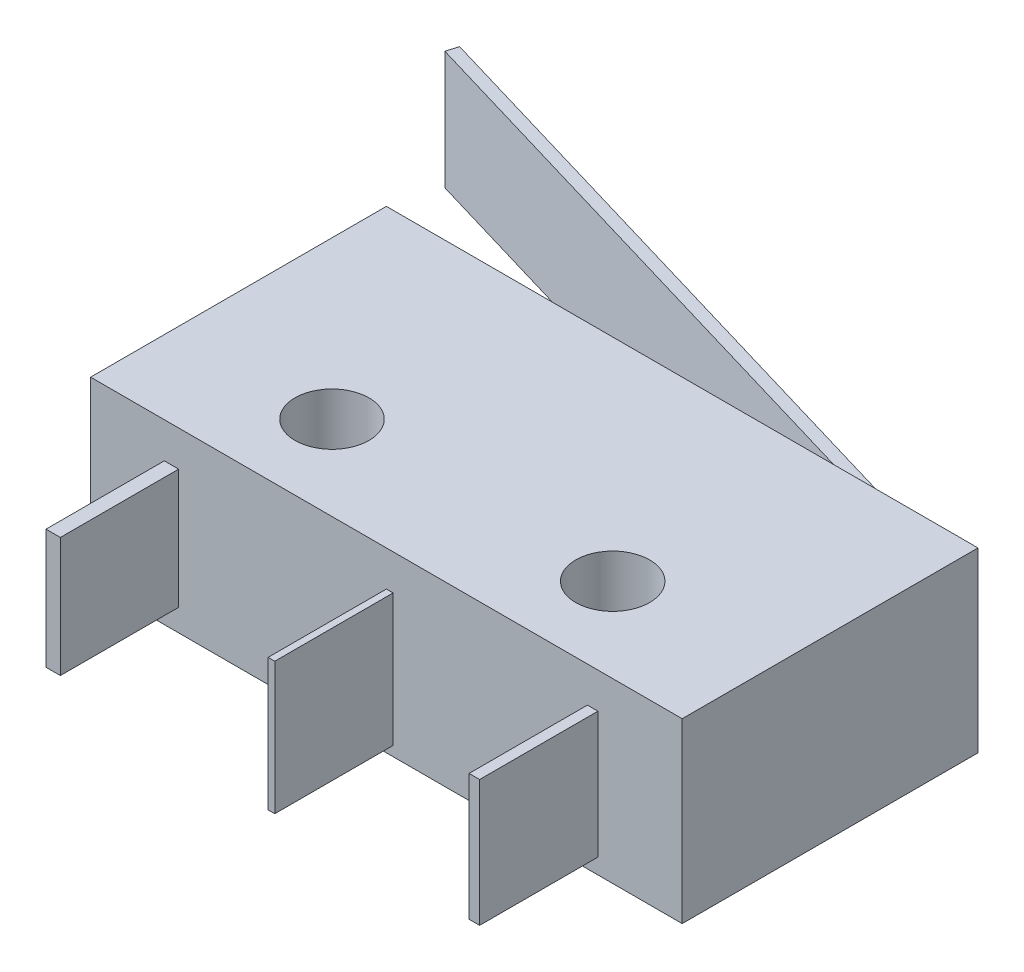
ISO-10303-21;
HEADER;
FILE_DESCRIPTION(('STEP AP214'),'2;1');
FILE_NAME('part.step','',(''),(''),'','','');
FILE_SCHEMA(('AUTOMOTIVE_DESIGN { 1 0 10303 214 1 1 1 1 }'));
ENDSEC;
DATA;
#1=APPLICATION_CONTEXT('core data for automotive mechanical design processes');
#2=APPLICATION_PROTOCOL_DEFINITION('international standard','automotive_design',2000,#1);
#3=PRODUCT_CONTEXT('',#1,'mechanical');
#4=PRODUCT('Part','Part','',(#3));
#5=PRODUCT_RELATED_PRODUCT_CATEGORY('part','',(#4));
#6=PRODUCT_DEFINITION_FORMATION('','',#4);
#7=PRODUCT_DEFINITION_CONTEXT('part definition',#1,'design');
#8=PRODUCT_DEFINITION('design','',#6,#7);
#9=PRODUCT_DEFINITION_SHAPE('','',#8);
#10=(LENGTH_UNIT() NAMED_UNIT(*) SI_UNIT(.MILLI.,.METRE.));
#11=(NAMED_UNIT(*) PLANE_ANGLE_UNIT() SI_UNIT($,.RADIAN.));
#12=(NAMED_UNIT(*) SI_UNIT($,.STERADIAN.) SOLID_ANGLE_UNIT());
#13=UNCERTAINTY_MEASURE_WITH_UNIT(LENGTH_MEASURE(1.E-05),#10,'distance_accuracy_value','');
#14=(GEOMETRIC_REPRESENTATION_CONTEXT(3) GLOBAL_UNCERTAINTY_ASSIGNED_CONTEXT((#13)) GLOBAL_UNIT_ASSIGNED_CONTEXT((#10,
#11,#12)) REPRESENTATION_CONTEXT('',''));
#15=CARTESIAN_POINT('',(0.,0.,0.));
#16=DIRECTION('',(0.,0.,1.));
#17=DIRECTION('',(1.,0.,0.));
#18=AXIS2_PLACEMENT_3D('',#15,#16,#17);
#19=CARTESIAN_POINT('',(7.61357254140113,1.,-5.38353784407759));
#20=DIRECTION('',(0.28393135350282,0.,-0.958844610193986));
#21=DIRECTION('',(-0.958844610193986,0.,-0.28393135350282));
#22=AXIS2_PLACEMENT_3D('',#19,#20,#21);
#23=PLANE('',#22);
#24=DIRECTION('',(-0.958844610193986,0.,-0.28393135350282));
#25=VECTOR('',#24,1.);
#26=CARTESIAN_POINT('',(7.61357254140113,5.,-5.38353784407759));
#27=LINE('',#26,#25);
#28=CARTESIAN_POINT('',(7.61357254140113,5.,-5.38353784407759));
#29=VERTEX_POINT('',#28);
#30=CARTESIAN_POINT('',(-14.4398534930605,5.,-11.9139589746425));
#31=VERTEX_POINT('',#30);
#32=EDGE_CURVE('E106',#29,#31,#27,.T.);
#33=ORIENTED_EDGE('',*,*,#32,.F.);
#34=DIRECTION('',(0.,1.,0.));
#35=VECTOR('',#34,1.);
#36=CARTESIAN_POINT('',(7.61357254140113,1.,-5.38353784407759));
#37=LINE('',#36,#35);
#38=CARTESIAN_POINT('',(7.61357254140113,1.,-5.38353784407759));
#39=VERTEX_POINT('',#38);
#40=EDGE_CURVE('E12',#39,#29,#37,.T.);
#41=ORIENTED_EDGE('',*,*,#40,.F.);
#42=DIRECTION('',(-0.958844610193986,0.,-0.28393135350282));
#43=VECTOR('',#42,1.);
#44=CARTESIAN_POINT('',(7.61357254140113,1.,-5.38353784407759));
#45=LINE('',#44,#43);
#46=CARTESIAN_POINT('',(-14.4398534930605,1.,-11.9139589746425));
#47=VERTEX_POINT('',#46);
#48=EDGE_CURVE('E101',#39,#47,#45,.T.);
#49=ORIENTED_EDGE('',*,*,#48,.T.);
#50=DIRECTION('',(0.,1.,0.));
#51=VECTOR('',#50,1.);
#52=CARTESIAN_POINT('',(-14.4398534930605,1.,-11.9139589746425));
#53=LINE('',#52,#51);
#54=EDGE_CURVE('E44',#47,#31,#53,.T.);
#55=ORIENTED_EDGE('',*,*,#54,.T.);
#56=EDGE_LOOP('',(#33,#41,#49,#55));
#57=FACE_BOUND('',#56,.T.);
#58=ADVANCED_FACE('F41',(#57),#23,.T.);
#59=CARTESIAN_POINT('',(7.61357254140113,1.,-5.38353784407759));
#60=DIRECTION('',(-0.958844610193986,0.,-0.28393135350282));
#61=DIRECTION('',(-0.28393135350282,0.,0.958844610193986));
#62=AXIS2_PLACEMENT_3D('',#59,#60,#61);
#63=PLANE('',#62);
#64=DIRECTION('',(-0.28393135350282,0.,0.958844610193986));
#65=VECTOR('',#64,1.);
#66=CARTESIAN_POINT('',(7.61357254140113,5.,-5.38353784407759));
#67=LINE('',#66,#65);
#68=CARTESIAN_POINT('',(7.5,5.,-5.));
#69=VERTEX_POINT('',#68);
#70=EDGE_CURVE('E74',#29,#69,#67,.T.);
#71=ORIENTED_EDGE('',*,*,#70,.T.);
#72=DIRECTION('',(0.,1.,0.));
#73=VECTOR('',#72,1.);
#74=CARTESIAN_POINT('',(7.5,1.,-5.));
#75=LINE('',#74,#73);
#76=CARTESIAN_POINT('',(7.5,1.,-5.));
#77=VERTEX_POINT('',#76);
#78=EDGE_CURVE('E50',#77,#69,#75,.T.);
#79=ORIENTED_EDGE('',*,*,#78,.F.);
#80=DIRECTION('',(-0.28393135350282,0.,0.958844610193986));
#81=VECTOR('',#80,1.);
#82=CARTESIAN_POINT('',(7.61357254140113,1.,-5.38353784407759));
#83=LINE('',#82,#81);
#84=EDGE_CURVE('E89',#39,#77,#83,.T.);
#85=ORIENTED_EDGE('',*,*,#84,.F.);
#86=ORIENTED_EDGE('',*,*,#40,.T.);
#87=EDGE_LOOP('',(#71,#79,#85,#86));
#88=FACE_BOUND('',#87,.T.);
#89=ADVANCED_FACE('F116',(#88),#63,.F.);
#90=CARTESIAN_POINT('',(7.5,1.,-5.));
#91=DIRECTION('',(0.28393135350282,0.,-0.958844610193986));
#92=DIRECTION('',(-0.958844610193986,0.,-0.28393135350282));
#93=AXIS2_PLACEMENT_3D('',#90,#91,#92);
#94=PLANE('',#93);
#95=DIRECTION('',(-0.958844610193986,0.,-0.28393135350282));
#96=VECTOR('',#95,1.);
#97=CARTESIAN_POINT('',(7.5,5.,-5.));
#98=LINE('',#97,#96);
#99=CARTESIAN_POINT('',(-14.5534260344617,5.,-11.5304211305649));
#100=VERTEX_POINT('',#99);
#101=EDGE_CURVE('E96',#69,#100,#98,.T.);
#102=ORIENTED_EDGE('',*,*,#101,.T.);
#103=DIRECTION('',(0.,1.,0.));
#104=VECTOR('',#103,1.);
#105=CARTESIAN_POINT('',(-14.5534260344617,1.,-11.5304211305649));
#106=LINE('',#105,#104);
#107=CARTESIAN_POINT('',(-14.5534260344617,1.,-11.5304211305649));
#108=VERTEX_POINT('',#107);
#109=EDGE_CURVE('E93',#108,#100,#106,.T.);
#110=ORIENTED_EDGE('',*,*,#109,.F.);
#111=DIRECTION('',(-0.958844610193986,0.,-0.28393135350282));
#112=VECTOR('',#111,1.);
#113=CARTESIAN_POINT('',(7.5,1.,-5.));
#114=LINE('',#113,#112);
#115=EDGE_CURVE('E86',#77,#108,#114,.T.);
#116=ORIENTED_EDGE('',*,*,#115,.F.);
#117=ORIENTED_EDGE('',*,*,#78,.T.);
#118=EDGE_LOOP('',(#102,#110,#116,#117));
#119=FACE_BOUND('',#118,.T.);
#120=ADVANCED_FACE('F94',(#119),#94,.F.);
#121=CARTESIAN_POINT('',(-14.5534260344617,1.,-11.5304211305649));
#122=DIRECTION('',(0.958844610193986,0.,0.28393135350282));
#123=DIRECTION('',(0.28393135350282,0.,-0.958844610193986));
#124=AXIS2_PLACEMENT_3D('',#121,#122,#123);
#125=PLANE('',#124);
#126=DIRECTION('',(0.28393135350282,0.,-0.958844610193986));
#127=VECTOR('',#126,1.);
#128=CARTESIAN_POINT('',(-14.5534260344617,5.,-11.5304211305649));
#129=LINE('',#128,#127);
#130=EDGE_CURVE('E109',#100,#31,#129,.T.);
#131=ORIENTED_EDGE('',*,*,#130,.T.);
#132=ORIENTED_EDGE('',*,*,#54,.F.);
#133=DIRECTION('',(0.28393135350282,0.,-0.958844610193986));
#134=VECTOR('',#133,1.);
#135=CARTESIAN_POINT('',(-14.5534260344617,1.,-11.5304211305649));
#136=LINE('',#135,#134);
#137=EDGE_CURVE('E83',#108,#47,#136,.T.);
#138=ORIENTED_EDGE('',*,*,#137,.F.);
#139=ORIENTED_EDGE('',*,*,#109,.T.);
#140=EDGE_LOOP('',(#131,#132,#138,#139));
#141=FACE_BOUND('',#140,.T.);
#142=ADVANCED_FACE('F100',(#141),#125,.F.);
#143=CARTESIAN_POINT('',(-14.4398534930605,1.,-11.9139589746425));
#144=DIRECTION('',(0.,-1.,0.));
#145=DIRECTION('',(0.,0.,-1.));
#146=AXIS2_PLACEMENT_3D('',#143,#144,#145);
#147=PLANE('',#146);
#148=ORIENTED_EDGE('',*,*,#48,.F.);
#149=ORIENTED_EDGE('',*,*,#84,.T.);
#150=ORIENTED_EDGE('',*,*,#115,.T.);
#151=ORIENTED_EDGE('',*,*,#137,.T.);
#152=EDGE_LOOP('',(#148,#149,#150,#151));
#153=FACE_BOUND('',#152,.T.);
#154=ADVANCED_FACE('F88',(#153),#147,.T.);
#155=CARTESIAN_POINT('',(-14.4398534930605,5.,-11.9139589746425));
#156=DIRECTION('',(0.,-1.,0.));
#157=DIRECTION('',(0.,0.,-1.));
#158=AXIS2_PLACEMENT_3D('',#155,#156,#157);
#159=PLANE('',#158);
#160=ORIENTED_EDGE('',*,*,#32,.T.);
#161=ORIENTED_EDGE('',*,*,#130,.F.);
#162=ORIENTED_EDGE('',*,*,#101,.F.);
#163=ORIENTED_EDGE('',*,*,#70,.F.);
#164=EDGE_LOOP('',(#160,#161,#162,#163));
#165=FACE_BOUND('',#164,.T.);
#166=ADVANCED_FACE('F114',(#165),#159,.F.);
#167=CLOSED_SHELL('',(#58,#89,#120,#142,#154,#166));
#168=MANIFOLD_SOLID_BREP('B2',#167);
#169=CARTESIAN_POINT('',(-10.,6.,5.));
#170=DIRECTION('',(0.,0.,-1.));
#171=DIRECTION('',(-1.,0.,0.));
#172=AXIS2_PLACEMENT_3D('',#169,#170,#171);
#173=PLANE('',#172);
#174=DIRECTION('',(0.,-1.,0.));
#175=VECTOR('',#174,1.);
#176=CARTESIAN_POINT('',(0.,4.79597395338313,5.));
#177=LINE('',#176,#175);
#178=CARTESIAN_POINT('',(0.,4.79597395338313,5.));
#179=VERTEX_POINT('',#178);
#180=CARTESIAN_POINT('',(0.,0.330308988214349,5.));
#181=VERTEX_POINT('',#180);
#182=EDGE_CURVE('E299',#179,#181,#177,.T.);
#183=ORIENTED_EDGE('',*,*,#182,.F.);
#184=DIRECTION('',(-1.,0.,0.));
#185=VECTOR('',#184,1.);
#186=CARTESIAN_POINT('',(0.,4.79597395338313,5.));
#187=LINE('',#186,#185);
#188=CARTESIAN_POINT('',(0.226519237363634,4.79597395338313,5.));
#189=VERTEX_POINT('',#188);
#190=EDGE_CURVE('E312',#189,#179,#187,.T.);
#191=ORIENTED_EDGE('',*,*,#190,.F.);
#192=DIRECTION('',(0.,1.,0.));
#193=VECTOR('',#192,1.);
#194=CARTESIAN_POINT('',(0.226519237363634,4.79597395338313,5.));
#195=LINE('',#194,#193);
#196=CARTESIAN_POINT('',(0.226519237363634,0.330308988214349,5.));
#197=VERTEX_POINT('',#196);
#198=EDGE_CURVE('E321',#197,#189,#195,.T.);
#199=ORIENTED_EDGE('',*,*,#198,.F.);
#200=DIRECTION('',(1.,0.,0.));
#201=VECTOR('',#200,1.);
#202=CARTESIAN_POINT('',(0.,0.330308988214349,5.));
#203=LINE('',#202,#201);
#204=EDGE_CURVE('E302',#181,#197,#203,.T.);
#205=ORIENTED_EDGE('',*,*,#204,.F.);
#206=EDGE_LOOP('',(#183,#191,#199,#205));
#207=FACE_BOUND('',#206,.T.);
#208=DIRECTION('',(1.,0.,0.));
#209=VECTOR('',#208,1.);
#210=CARTESIAN_POINT('',(-10.,0.,5.));
#211=LINE('',#210,#209);
#212=CARTESIAN_POINT('',(-10.,0.,5.));
#213=VERTEX_POINT('',#212);
#214=CARTESIAN_POINT('',(10.,0.,5.));
#215=VERTEX_POINT('',#214);
#216=EDGE_CURVE('E387',#213,#215,#211,.T.);
#217=ORIENTED_EDGE('',*,*,#216,.T.);
#218=DIRECTION('',(0.,-1.,0.));
#219=VECTOR('',#218,1.);
#220=CARTESIAN_POINT('',(10.,6.,5.));
#221=LINE('',#220,#219);
#222=CARTESIAN_POINT('',(10.,6.,5.));
#223=VERTEX_POINT('',#222);
#224=EDGE_CURVE('E393',#223,#215,#221,.T.);
#225=ORIENTED_EDGE('',*,*,#224,.F.);
#226=DIRECTION('',(1.,0.,0.));
#227=VECTOR('',#226,1.);
#228=CARTESIAN_POINT('',(-10.,6.,5.));
#229=LINE('',#228,#227);
#230=CARTESIAN_POINT('',(-10.,6.,5.));
#231=VERTEX_POINT('',#230);
#232=EDGE_CURVE('E391',#231,#223,#229,.T.);
#233=ORIENTED_EDGE('',*,*,#232,.F.);
#234=DIRECTION('',(0.,-1.,0.));
#235=VECTOR('',#234,1.);
#236=CARTESIAN_POINT('',(-10.,6.,5.));
#237=LINE('',#236,#235);
#238=EDGE_CURVE('E403',#231,#213,#237,.T.);
#239=ORIENTED_EDGE('',*,*,#238,.T.);
#240=EDGE_LOOP('',(#217,#225,#233,#239));
#241=FACE_BOUND('',#240,.T.);
#242=DIRECTION('',(0.,-1.,0.));
#243=VECTOR('',#242,1.);
#244=CARTESIAN_POINT('',(-7.50749472405187,4.79597395338313,5.));
#245=LINE('',#244,#243);
#246=CARTESIAN_POINT('',(-7.50749472405187,4.79597395338313,5.));
#247=VERTEX_POINT('',#246);
#248=CARTESIAN_POINT('',(-7.50749472405187,0.750987571889667,5.));
#249=VERTEX_POINT('',#248);
#250=EDGE_CURVE('E337',#247,#249,#245,.T.);
#251=ORIENTED_EDGE('',*,*,#250,.F.);
#252=DIRECTION('',(-1.,0.,0.));
#253=VECTOR('',#252,1.);
#254=CARTESIAN_POINT('',(-7.50749472405187,4.79597395338313,5.));
#255=LINE('',#254,#253);
#256=CARTESIAN_POINT('',(-7.02209635827265,4.79597395338313,5.));
#257=VERTEX_POINT('',#256);
#258=EDGE_CURVE('E342',#257,#247,#255,.T.);
#259=ORIENTED_EDGE('',*,*,#258,.F.);
#260=DIRECTION('',(0.,1.,0.));
#261=VECTOR('',#260,1.);
#262=CARTESIAN_POINT('',(-7.02209635827265,4.79597395338313,5.));
#263=LINE('',#262,#261);
#264=CARTESIAN_POINT('',(-7.02209635827265,0.750987571889667,5.));
#265=VERTEX_POINT('',#264);
#266=EDGE_CURVE('E354',#265,#257,#263,.T.);
#267=ORIENTED_EDGE('',*,*,#266,.F.);
#268=DIRECTION('',(1.,0.,0.));
#269=VECTOR('',#268,1.);
#270=CARTESIAN_POINT('',(-7.50749472405187,0.750987571889668,5.));
#271=LINE('',#270,#269);
#272=EDGE_CURVE('E351',#249,#265,#271,.T.);
#273=ORIENTED_EDGE('',*,*,#272,.F.);
#274=EDGE_LOOP('',(#251,#259,#267,#273));
#275=FACE_BOUND('',#274,.T.);
#276=DIRECTION('',(0.,-1.,0.));
#277=VECTOR('',#276,1.);
#278=CARTESIAN_POINT('',(6.79557712090902,4.79597395338313,5.));
#279=LINE('',#278,#277);
#280=CARTESIAN_POINT('',(6.79557712090902,4.79597395338313,5.));
#281=VERTEX_POINT('',#280);
#282=CARTESIAN_POINT('',(6.79557712090902,0.524468334526034,5.));
#283=VERTEX_POINT('',#282);
#284=EDGE_CURVE('E298',#281,#283,#279,.T.);
#285=ORIENTED_EDGE('',*,*,#284,.F.);
#286=DIRECTION('',(-1.,0.,0.));
#287=VECTOR('',#286,1.);
#288=CARTESIAN_POINT('',(6.79557712090902,4.79597395338313,5.));
#289=LINE('',#288,#287);
#290=CARTESIAN_POINT('',(7.15153592248044,4.79597395338313,5.));
#291=VERTEX_POINT('',#290);
#292=EDGE_CURVE('E295',#291,#281,#289,.T.);
#293=ORIENTED_EDGE('',*,*,#292,.F.);
#294=DIRECTION('',(0.,1.,0.));
#295=VECTOR('',#294,1.);
#296=CARTESIAN_POINT('',(7.15153592248044,4.79597395338313,5.));
#297=LINE('',#296,#295);
#298=CARTESIAN_POINT('',(7.15153592248044,0.524468334526034,5.));
#299=VERTEX_POINT('',#298);
#300=EDGE_CURVE('E185',#299,#291,#297,.T.);
#301=ORIENTED_EDGE('',*,*,#300,.F.);
#302=DIRECTION('',(1.,0.,0.));
#303=VECTOR('',#302,1.);
#304=CARTESIAN_POINT('',(6.79557712090902,0.524468334526034,5.));
#305=LINE('',#304,#303);
#306=EDGE_CURVE('E180',#283,#299,#305,.T.);
#307=ORIENTED_EDGE('',*,*,#306,.F.);
#308=EDGE_LOOP('',(#285,#293,#301,#307));
#309=FACE_BOUND('',#308,.T.);
#310=ADVANCED_FACE('F165',(#207,#241,#275,#309),#173,.F.);
#311=CARTESIAN_POINT('',(10.,6.,5.));
#312=DIRECTION('',(0.,1.,0.));
#313=DIRECTION('',(0.,0.,1.));
#314=AXIS2_PLACEMENT_3D('',#311,#312,#313);
#315=PLANE('',#314);
#316=CARTESIAN_POINT('',(-4.69,6.,2.15));
#317=DIRECTION('',(0.,1.,0.));
#318=DIRECTION('',(0.,0.,1.));
#319=AXIS2_PLACEMENT_3D('',#316,#317,#318);
#320=CIRCLE('',#319,1.25);
#321=CARTESIAN_POINT('',(-4.69,6.,3.4));
#322=VERTEX_POINT('',#321);
#323=EDGE_CURVE('E377',#322,#322,#320,.T.);
#324=ORIENTED_EDGE('',*,*,#323,.F.);
#325=EDGE_LOOP('',(#324));
#326=FACE_BOUND('',#325,.T.);
#327=DIRECTION('',(0.,0.,-1.));
#328=VECTOR('',#327,1.);
#329=CARTESIAN_POINT('',(10.,6.,-5.));
#330=LINE('',#329,#328);
#331=CARTESIAN_POINT('',(10.,6.,-5.));
#332=VERTEX_POINT('',#331);
#333=EDGE_CURVE('E383',#223,#332,#330,.T.);
#334=ORIENTED_EDGE('',*,*,#333,.T.);
#335=DIRECTION('',(-1.,0.,0.));
#336=VECTOR('',#335,1.);
#337=CARTESIAN_POINT('',(-10.,6.,-5.));
#338=LINE('',#337,#336);
#339=CARTESIAN_POINT('',(-10.,6.,-5.));
#340=VERTEX_POINT('',#339);
#341=EDGE_CURVE('E386',#332,#340,#338,.T.);
#342=ORIENTED_EDGE('',*,*,#341,.T.);
#343=DIRECTION('',(0.,0.,1.));
#344=VECTOR('',#343,1.);
#345=CARTESIAN_POINT('',(-10.,6.,-5.));
#346=LINE('',#345,#344);
#347=EDGE_CURVE('E389',#340,#231,#346,.T.);
#348=ORIENTED_EDGE('',*,*,#347,.T.);
#349=ORIENTED_EDGE('',*,*,#232,.T.);
#350=EDGE_LOOP('',(#334,#342,#348,#349));
#351=FACE_BOUND('',#350,.T.);
#352=CARTESIAN_POINT('',(4.8,6.,2.15));
#353=DIRECTION('',(0.,1.,0.));
#354=DIRECTION('',(0.,0.,1.));
#355=AXIS2_PLACEMENT_3D('',#352,#353,#354);
#356=CIRCLE('',#355,1.25);
#357=CARTESIAN_POINT('',(4.8,6.,3.4));
#358=VERTEX_POINT('',#357);
#359=EDGE_CURVE('E371',#358,#358,#356,.T.);
#360=ORIENTED_EDGE('',*,*,#359,.F.);
#361=EDGE_LOOP('',(#360));
#362=FACE_BOUND('',#361,.T.);
#363=ADVANCED_FACE('F426',(#326,#351,#362),#315,.T.);
#364=CARTESIAN_POINT('',(10.,0.,5.));
#365=DIRECTION('',(0.,1.,0.));
#366=DIRECTION('',(0.,0.,1.));
#367=AXIS2_PLACEMENT_3D('',#364,#365,#366);
#368=PLANE('',#367);
#369=CARTESIAN_POINT('',(-4.69,0.,2.15));
#370=DIRECTION('',(0.,1.,0.));
#371=DIRECTION('',(0.,0.,1.));
#372=AXIS2_PLACEMENT_3D('',#369,#370,#371);
#373=CIRCLE('',#372,1.25);
#374=CARTESIAN_POINT('',(-4.69,0.,3.4));
#375=VERTEX_POINT('',#374);
#376=EDGE_CURVE('E374',#375,#375,#373,.T.);
#377=ORIENTED_EDGE('',*,*,#376,.T.);
#378=EDGE_LOOP('',(#377));
#379=FACE_BOUND('',#378,.T.);
#380=DIRECTION('',(0.,0.,-1.));
#381=VECTOR('',#380,1.);
#382=CARTESIAN_POINT('',(10.,0.,-5.));
#383=LINE('',#382,#381);
#384=CARTESIAN_POINT('',(10.,0.,-5.));
#385=VERTEX_POINT('',#384);
#386=EDGE_CURVE('E380',#215,#385,#383,.T.);
#387=ORIENTED_EDGE('',*,*,#386,.F.);
#388=ORIENTED_EDGE('',*,*,#216,.F.);
#389=DIRECTION('',(0.,0.,1.));
#390=VECTOR('',#389,1.);
#391=CARTESIAN_POINT('',(-10.,0.,-5.));
#392=LINE('',#391,#390);
#393=CARTESIAN_POINT('',(-10.,0.,-5.));
#394=VERTEX_POINT('',#393);
#395=EDGE_CURVE('E398',#394,#213,#392,.T.);
#396=ORIENTED_EDGE('',*,*,#395,.F.);
#397=DIRECTION('',(-1.,0.,0.));
#398=VECTOR('',#397,1.);
#399=CARTESIAN_POINT('',(-10.,0.,-5.));
#400=LINE('',#399,#398);
#401=EDGE_CURVE('E396',#385,#394,#400,.T.);
#402=ORIENTED_EDGE('',*,*,#401,.F.);
#403=EDGE_LOOP('',(#387,#388,#396,#402));
#404=FACE_BOUND('',#403,.T.);
#405=CARTESIAN_POINT('',(4.8,0.,2.15));
#406=DIRECTION('',(0.,1.,0.));
#407=DIRECTION('',(0.,0.,1.));
#408=AXIS2_PLACEMENT_3D('',#405,#406,#407);
#409=CIRCLE('',#408,1.25);
#410=CARTESIAN_POINT('',(4.8,0.,3.4));
#411=VERTEX_POINT('',#410);
#412=EDGE_CURVE('E370',#411,#411,#409,.T.);
#413=ORIENTED_EDGE('',*,*,#412,.T.);
#414=EDGE_LOOP('',(#413));
#415=FACE_BOUND('',#414,.T.);
#416=ADVANCED_FACE('F416',(#379,#404,#415),#368,.F.);
#417=CARTESIAN_POINT('',(10.,6.,-5.));
#418=DIRECTION('',(-1.,0.,0.));
#419=DIRECTION('',(0.,0.,1.));
#420=AXIS2_PLACEMENT_3D('',#417,#418,#419);
#421=PLANE('',#420);
#422=ORIENTED_EDGE('',*,*,#386,.T.);
#423=DIRECTION('',(0.,-1.,0.));
#424=VECTOR('',#423,1.);
#425=CARTESIAN_POINT('',(10.,6.,-5.));
#426=LINE('',#425,#424);
#427=EDGE_CURVE('E39',#332,#385,#426,.T.);
#428=ORIENTED_EDGE('',*,*,#427,.F.);
#429=ORIENTED_EDGE('',*,*,#333,.F.);
#430=ORIENTED_EDGE('',*,*,#224,.T.);
#431=EDGE_LOOP('',(#422,#428,#429,#430));
#432=FACE_BOUND('',#431,.T.);
#433=ADVANCED_FACE('F167',(#432),#421,.F.);
#434=CARTESIAN_POINT('',(-10.,6.,-5.));
#435=DIRECTION('',(0.,0.,1.));
#436=DIRECTION('',(1.,0.,0.));
#437=AXIS2_PLACEMENT_3D('',#434,#435,#436);
#438=PLANE('',#437);
#439=ORIENTED_EDGE('',*,*,#401,.T.);
#440=DIRECTION('',(0.,-1.,0.));
#441=VECTOR('',#440,1.);
#442=CARTESIAN_POINT('',(-10.,6.,-5.));
#443=LINE('',#442,#441);
#444=EDGE_CURVE('E173',#340,#394,#443,.T.);
#445=ORIENTED_EDGE('',*,*,#444,.F.);
#446=ORIENTED_EDGE('',*,*,#341,.F.);
#447=ORIENTED_EDGE('',*,*,#427,.T.);
#448=EDGE_LOOP('',(#439,#445,#446,#447));
#449=FACE_BOUND('',#448,.T.);
#450=ADVANCED_FACE('F428',(#449),#438,.F.);
#451=CARTESIAN_POINT('',(-10.,6.,-5.));
#452=DIRECTION('',(1.,0.,0.));
#453=DIRECTION('',(0.,0.,-1.));
#454=AXIS2_PLACEMENT_3D('',#451,#452,#453);
#455=PLANE('',#454);
#456=ORIENTED_EDGE('',*,*,#395,.T.);
#457=ORIENTED_EDGE('',*,*,#238,.F.);
#458=ORIENTED_EDGE('',*,*,#347,.F.);
#459=ORIENTED_EDGE('',*,*,#444,.T.);
#460=EDGE_LOOP('',(#456,#457,#458,#459));
#461=FACE_BOUND('',#460,.T.);
#462=ADVANCED_FACE('F410',(#461),#455,.F.);
#463=CARTESIAN_POINT('',(-4.69,6.,2.15));
#464=DIRECTION('',(0.,-1.,0.));
#465=DIRECTION('',(0.,0.,-1.));
#466=AXIS2_PLACEMENT_3D('',#463,#464,#465);
#467=CYLINDRICAL_SURFACE('',#466,1.25);
#468=ORIENTED_EDGE('',*,*,#323,.T.);
#469=EDGE_LOOP('',(#468));
#470=FACE_BOUND('',#469,.T.);
#471=ORIENTED_EDGE('',*,*,#376,.F.);
#472=EDGE_LOOP('',(#471));
#473=FACE_BOUND('',#472,.T.);
#474=ADVANCED_FACE('F434',(#470,#473),#467,.F.);
#475=CARTESIAN_POINT('',(4.8,6.,2.15));
#476=DIRECTION('',(0.,-1.,0.));
#477=DIRECTION('',(0.,0.,-1.));
#478=AXIS2_PLACEMENT_3D('',#475,#476,#477);
#479=CYLINDRICAL_SURFACE('',#478,1.25);
#480=ORIENTED_EDGE('',*,*,#359,.T.);
#481=EDGE_LOOP('',(#480));
#482=FACE_BOUND('',#481,.T.);
#483=ORIENTED_EDGE('',*,*,#412,.F.);
#484=EDGE_LOOP('',(#483));
#485=FACE_BOUND('',#484,.T.);
#486=ADVANCED_FACE('F450',(#482,#485),#479,.F.);
#487=CARTESIAN_POINT('',(-7.50749472405187,4.79597395338313,9.));
#488=DIRECTION('',(1.,0.,0.));
#489=DIRECTION('',(0.,0.,-1.));
#490=AXIS2_PLACEMENT_3D('',#487,#488,#489);
#491=PLANE('',#490);
#492=ORIENTED_EDGE('',*,*,#250,.T.);
#493=DIRECTION('',(0.,0.,-1.));
#494=VECTOR('',#493,1.);
#495=CARTESIAN_POINT('',(-7.50749472405187,0.750987571889668,9.));
#496=LINE('',#495,#494);
#497=CARTESIAN_POINT('',(-7.50749472405187,0.750987571889668,9.));
#498=VERTEX_POINT('',#497);
#499=EDGE_CURVE('E367',#498,#249,#496,.T.);
#500=ORIENTED_EDGE('',*,*,#499,.F.);
#501=DIRECTION('',(0.,-1.,0.));
#502=VECTOR('',#501,1.);
#503=CARTESIAN_POINT('',(-7.50749472405187,4.79597395338313,9.));
#504=LINE('',#503,#502);
#505=CARTESIAN_POINT('',(-7.50749472405187,4.79597395338313,9.));
#506=VERTEX_POINT('',#505);
#507=EDGE_CURVE('E338',#506,#498,#504,.T.);
#508=ORIENTED_EDGE('',*,*,#507,.F.);
#509=DIRECTION('',(0.,0.,-1.));
#510=VECTOR('',#509,1.);
#511=CARTESIAN_POINT('',(-7.50749472405187,4.79597395338313,9.));
#512=LINE('',#511,#510);
#513=EDGE_CURVE('E348',#506,#247,#512,.T.);
#514=ORIENTED_EDGE('',*,*,#513,.T.);
#515=EDGE_LOOP('',(#492,#500,#508,#514));
#516=FACE_BOUND('',#515,.T.);
#517=ADVANCED_FACE('F454',(#516),#491,.F.);
#518=CARTESIAN_POINT('',(-7.50749472405187,0.750987571889668,9.));
#519=DIRECTION('',(0.,1.,0.));
#520=DIRECTION('',(0.,0.,1.));
#521=AXIS2_PLACEMENT_3D('',#518,#519,#520);
#522=PLANE('',#521);
#523=ORIENTED_EDGE('',*,*,#272,.T.);
#524=DIRECTION('',(0.,0.,-1.));
#525=VECTOR('',#524,1.);
#526=CARTESIAN_POINT('',(-7.02209635827265,0.750987571889668,9.));
#527=LINE('',#526,#525);
#528=CARTESIAN_POINT('',(-7.02209635827265,0.750987571889668,9.));
#529=VERTEX_POINT('',#528);
#530=EDGE_CURVE('E364',#529,#265,#527,.T.);
#531=ORIENTED_EDGE('',*,*,#530,.F.);
#532=DIRECTION('',(1.,0.,0.));
#533=VECTOR('',#532,1.);
#534=CARTESIAN_POINT('',(-7.50749472405187,0.750987571889668,9.));
#535=LINE('',#534,#533);
#536=EDGE_CURVE('E341',#498,#529,#535,.T.);
#537=ORIENTED_EDGE('',*,*,#536,.F.);
#538=ORIENTED_EDGE('',*,*,#499,.T.);
#539=EDGE_LOOP('',(#523,#531,#537,#538));
#540=FACE_BOUND('',#539,.T.);
#541=ADVANCED_FACE('F458',(#540),#522,.F.);
#542=CARTESIAN_POINT('',(-7.02209635827265,4.79597395338313,9.));
#543=DIRECTION('',(-1.,0.,0.));
#544=DIRECTION('',(0.,0.,1.));
#545=AXIS2_PLACEMENT_3D('',#542,#543,#544);
#546=PLANE('',#545);
#547=ORIENTED_EDGE('',*,*,#266,.T.);
#548=DIRECTION('',(0.,0.,-1.));
#549=VECTOR('',#548,1.);
#550=CARTESIAN_POINT('',(-7.02209635827265,4.79597395338313,9.));
#551=LINE('',#550,#549);
#552=CARTESIAN_POINT('',(-7.02209635827265,4.79597395338313,9.));
#553=VERTEX_POINT('',#552);
#554=EDGE_CURVE('E361',#553,#257,#551,.T.);
#555=ORIENTED_EDGE('',*,*,#554,.F.);
#556=DIRECTION('',(0.,1.,0.));
#557=VECTOR('',#556,1.);
#558=CARTESIAN_POINT('',(-7.02209635827265,4.79597395338313,9.));
#559=LINE('',#558,#557);
#560=EDGE_CURVE('E344',#529,#553,#559,.T.);
#561=ORIENTED_EDGE('',*,*,#560,.F.);
#562=ORIENTED_EDGE('',*,*,#530,.T.);
#563=EDGE_LOOP('',(#547,#555,#561,#562));
#564=FACE_BOUND('',#563,.T.);
#565=ADVANCED_FACE('F462',(#564),#546,.F.);
#566=CARTESIAN_POINT('',(-7.50749472405187,4.79597395338313,9.));
#567=DIRECTION('',(0.,-1.,0.));
#568=DIRECTION('',(0.,0.,-1.));
#569=AXIS2_PLACEMENT_3D('',#566,#567,#568);
#570=PLANE('',#569);
#571=ORIENTED_EDGE('',*,*,#258,.T.);
#572=ORIENTED_EDGE('',*,*,#513,.F.);
#573=DIRECTION('',(-1.,0.,0.));
#574=VECTOR('',#573,1.);
#575=CARTESIAN_POINT('',(-7.50749472405187,4.79597395338313,9.));
#576=LINE('',#575,#574);
#577=EDGE_CURVE('E346',#553,#506,#576,.T.);
#578=ORIENTED_EDGE('',*,*,#577,.F.);
#579=ORIENTED_EDGE('',*,*,#554,.T.);
#580=EDGE_LOOP('',(#571,#572,#578,#579));
#581=FACE_BOUND('',#580,.T.);
#582=ADVANCED_FACE('F466',(#581),#570,.F.);
#583=CARTESIAN_POINT('',(-7.50749472405187,0.750987571889668,9.));
#584=DIRECTION('',(0.,0.,1.));
#585=DIRECTION('',(1.,0.,0.));
#586=AXIS2_PLACEMENT_3D('',#583,#584,#585);
#587=PLANE('',#586);
#588=ORIENTED_EDGE('',*,*,#507,.T.);
#589=ORIENTED_EDGE('',*,*,#536,.T.);
#590=ORIENTED_EDGE('',*,*,#560,.T.);
#591=ORIENTED_EDGE('',*,*,#577,.T.);
#592=EDGE_LOOP('',(#588,#589,#590,#591));
#593=FACE_BOUND('',#592,.T.);
#594=ADVANCED_FACE('F470',(#593),#587,.T.);
#595=CARTESIAN_POINT('',(0.,4.79597395338313,9.));
#596=DIRECTION('',(1.,0.,0.));
#597=DIRECTION('',(0.,1.,0.));
#598=AXIS2_PLACEMENT_3D('',#595,#596,#597);
#599=PLANE('',#598);
#600=ORIENTED_EDGE('',*,*,#182,.T.);
#601=DIRECTION('',(0.,0.,-1.));
#602=VECTOR('',#601,1.);
#603=CARTESIAN_POINT('',(0.,0.330308988214349,9.));
#604=LINE('',#603,#602);
#605=CARTESIAN_POINT('',(0.,0.330308988214349,9.));
#606=VERTEX_POINT('',#605);
#607=EDGE_CURVE('E334',#606,#181,#604,.T.);
#608=ORIENTED_EDGE('',*,*,#607,.F.);
#609=DIRECTION('',(0.,-1.,0.));
#610=VECTOR('',#609,1.);
#611=CARTESIAN_POINT('',(0.,4.79597395338313,9.));
#612=LINE('',#611,#610);
#613=CARTESIAN_POINT('',(0.,4.79597395338313,9.));
#614=VERTEX_POINT('',#613);
#615=EDGE_CURVE('E308',#614,#606,#612,.T.);
#616=ORIENTED_EDGE('',*,*,#615,.F.);
#617=DIRECTION('',(0.,0.,-1.));
#618=VECTOR('',#617,1.);
#619=CARTESIAN_POINT('',(0.,4.79597395338313,9.));
#620=LINE('',#619,#618);
#621=EDGE_CURVE('E317',#614,#179,#620,.T.);
#622=ORIENTED_EDGE('',*,*,#621,.T.);
#623=EDGE_LOOP('',(#600,#608,#616,#622));
#624=FACE_BOUND('',#623,.T.);
#625=ADVANCED_FACE('F474',(#624),#599,.F.);
#626=CARTESIAN_POINT('',(0.,0.330308988214349,9.));
#627=DIRECTION('',(0.,1.,0.));
#628=DIRECTION('',(0.,0.,1.));
#629=AXIS2_PLACEMENT_3D('',#626,#627,#628);
#630=PLANE('',#629);
#631=ORIENTED_EDGE('',*,*,#204,.T.);
#632=DIRECTION('',(0.,0.,-1.));
#633=VECTOR('',#632,1.);
#634=CARTESIAN_POINT('',(0.226519237363634,0.330308988214349,9.));
#635=LINE('',#634,#633);
#636=CARTESIAN_POINT('',(0.226519237363634,0.330308988214349,9.));
#637=VERTEX_POINT('',#636);
#638=EDGE_CURVE('E331',#637,#197,#635,.T.);
#639=ORIENTED_EDGE('',*,*,#638,.F.);
#640=DIRECTION('',(1.,0.,0.));
#641=VECTOR('',#640,1.);
#642=CARTESIAN_POINT('',(0.,0.330308988214349,9.));
#643=LINE('',#642,#641);
#644=EDGE_CURVE('E311',#606,#637,#643,.T.);
#645=ORIENTED_EDGE('',*,*,#644,.F.);
#646=ORIENTED_EDGE('',*,*,#607,.T.);
#647=EDGE_LOOP('',(#631,#639,#645,#646));
#648=FACE_BOUND('',#647,.T.);
#649=ADVANCED_FACE('F478',(#648),#630,.F.);
#650=CARTESIAN_POINT('',(0.226519237363634,4.79597395338313,9.));
#651=DIRECTION('',(-1.,0.,0.));
#652=DIRECTION('',(0.,0.,1.));
#653=AXIS2_PLACEMENT_3D('',#650,#651,#652);
#654=PLANE('',#653);
#655=ORIENTED_EDGE('',*,*,#198,.T.);
#656=DIRECTION('',(0.,0.,-1.));
#657=VECTOR('',#656,1.);
#658=CARTESIAN_POINT('',(0.226519237363634,4.79597395338313,9.));
#659=LINE('',#658,#657);
#660=CARTESIAN_POINT('',(0.226519237363634,4.79597395338313,9.));
#661=VERTEX_POINT('',#660);
#662=EDGE_CURVE('E328',#661,#189,#659,.T.);
#663=ORIENTED_EDGE('',*,*,#662,.F.);
#664=DIRECTION('',(0.,1.,0.));
#665=VECTOR('',#664,1.);
#666=CARTESIAN_POINT('',(0.226519237363634,4.79597395338313,9.));
#667=LINE('',#666,#665);
#668=EDGE_CURVE('E314',#637,#661,#667,.T.);
#669=ORIENTED_EDGE('',*,*,#668,.F.);
#670=ORIENTED_EDGE('',*,*,#638,.T.);
#671=EDGE_LOOP('',(#655,#663,#669,#670));
#672=FACE_BOUND('',#671,.T.);
#673=ADVANCED_FACE('F482',(#672),#654,.F.);
#674=CARTESIAN_POINT('',(0.,4.79597395338313,9.));
#675=DIRECTION('',(0.,-1.,0.));
#676=DIRECTION('',(0.,0.,-1.));
#677=AXIS2_PLACEMENT_3D('',#674,#675,#676);
#678=PLANE('',#677);
#679=ORIENTED_EDGE('',*,*,#190,.T.);
#680=ORIENTED_EDGE('',*,*,#621,.F.);
#681=DIRECTION('',(-1.,0.,0.));
#682=VECTOR('',#681,1.);
#683=CARTESIAN_POINT('',(0.,4.79597395338313,9.));
#684=LINE('',#683,#682);
#685=EDGE_CURVE('E316',#661,#614,#684,.T.);
#686=ORIENTED_EDGE('',*,*,#685,.F.);
#687=ORIENTED_EDGE('',*,*,#662,.T.);
#688=EDGE_LOOP('',(#679,#680,#686,#687));
#689=FACE_BOUND('',#688,.T.);
#690=ADVANCED_FACE('F486',(#689),#678,.F.);
#691=CARTESIAN_POINT('',(0.,0.330308988214349,9.));
#692=DIRECTION('',(0.,0.,1.));
#693=DIRECTION('',(1.,0.,0.));
#694=AXIS2_PLACEMENT_3D('',#691,#692,#693);
#695=PLANE('',#694);
#696=ORIENTED_EDGE('',*,*,#615,.T.);
#697=ORIENTED_EDGE('',*,*,#644,.T.);
#698=ORIENTED_EDGE('',*,*,#668,.T.);
#699=ORIENTED_EDGE('',*,*,#685,.T.);
#700=EDGE_LOOP('',(#696,#697,#698,#699));
#701=FACE_BOUND('',#700,.T.);
#702=ADVANCED_FACE('F490',(#701),#695,.T.);
#703=CARTESIAN_POINT('',(6.79557712090902,4.79597395338313,9.));
#704=DIRECTION('',(1.,0.,0.));
#705=DIRECTION('',(0.,0.,-1.));
#706=AXIS2_PLACEMENT_3D('',#703,#704,#705);
#707=PLANE('',#706);
#708=ORIENTED_EDGE('',*,*,#284,.T.);
#709=DIRECTION('',(0.,0.,-1.));
#710=VECTOR('',#709,1.);
#711=CARTESIAN_POINT('',(6.79557712090902,0.524468334526034,9.));
#712=LINE('',#711,#710);
#713=CARTESIAN_POINT('',(6.79557712090902,0.524468334526034,9.));
#714=VERTEX_POINT('',#713);
#715=EDGE_CURVE('E279',#714,#283,#712,.T.);
#716=ORIENTED_EDGE('',*,*,#715,.F.);
#717=DIRECTION('',(0.,-1.,0.));
#718=VECTOR('',#717,1.);
#719=CARTESIAN_POINT('',(6.79557712090902,4.79597395338313,9.));
#720=LINE('',#719,#718);
#721=CARTESIAN_POINT('',(6.79557712090902,4.79597395338313,9.));
#722=VERTEX_POINT('',#721);
#723=EDGE_CURVE('E286',#722,#714,#720,.T.);
#724=ORIENTED_EDGE('',*,*,#723,.F.);
#725=DIRECTION('',(0.,0.,-1.));
#726=VECTOR('',#725,1.);
#727=CARTESIAN_POINT('',(6.79557712090902,4.79597395338313,9.));
#728=LINE('',#727,#726);
#729=EDGE_CURVE('E642',#722,#281,#728,.T.);
#730=ORIENTED_EDGE('',*,*,#729,.T.);
#731=EDGE_LOOP('',(#708,#716,#724,#730));
#732=FACE_BOUND('',#731,.T.);
#733=ADVANCED_FACE('F297',(#732),#707,.F.);
#734=CARTESIAN_POINT('',(6.79557712090902,0.524468334526034,9.));
#735=DIRECTION('',(0.,1.,0.));
#736=DIRECTION('',(0.,0.,1.));
#737=AXIS2_PLACEMENT_3D('',#734,#735,#736);
#738=PLANE('',#737);
#739=ORIENTED_EDGE('',*,*,#306,.T.);
#740=DIRECTION('',(0.,0.,-1.));
#741=VECTOR('',#740,1.);
#742=CARTESIAN_POINT('',(7.15153592248044,0.524468334526034,9.));
#743=LINE('',#742,#741);
#744=CARTESIAN_POINT('',(7.15153592248044,0.524468334526034,9.));
#745=VERTEX_POINT('',#744);
#746=EDGE_CURVE('E282',#745,#299,#743,.T.);
#747=ORIENTED_EDGE('',*,*,#746,.F.);
#748=DIRECTION('',(1.,0.,0.));
#749=VECTOR('',#748,1.);
#750=CARTESIAN_POINT('',(6.79557712090902,0.524468334526034,9.));
#751=LINE('',#750,#749);
#752=EDGE_CURVE('E275',#714,#745,#751,.T.);
#753=ORIENTED_EDGE('',*,*,#752,.F.);
#754=ORIENTED_EDGE('',*,*,#715,.T.);
#755=EDGE_LOOP('',(#739,#747,#753,#754));
#756=FACE_BOUND('',#755,.T.);
#757=ADVANCED_FACE('F277',(#756),#738,.F.);
#758=CARTESIAN_POINT('',(7.15153592248044,4.79597395338313,9.));
#759=DIRECTION('',(-1.,0.,0.));
#760=DIRECTION('',(0.,0.,1.));
#761=AXIS2_PLACEMENT_3D('',#758,#759,#760);
#762=PLANE('',#761);
#763=ORIENTED_EDGE('',*,*,#300,.T.);
#764=DIRECTION('',(0.,0.,-1.));
#765=VECTOR('',#764,1.);
#766=CARTESIAN_POINT('',(7.15153592248044,4.79597395338313,9.));
#767=LINE('',#766,#765);
#768=CARTESIAN_POINT('',(7.15153592248044,4.79597395338313,9.));
#769=VERTEX_POINT('',#768);
#770=EDGE_CURVE('E304',#769,#291,#767,.T.);
#771=ORIENTED_EDGE('',*,*,#770,.F.);
#772=DIRECTION('',(0.,1.,0.));
#773=VECTOR('',#772,1.);
#774=CARTESIAN_POINT('',(7.15153592248044,4.79597395338313,9.));
#775=LINE('',#774,#773);
#776=EDGE_CURVE('E285',#745,#769,#775,.T.);
#777=ORIENTED_EDGE('',*,*,#776,.F.);
#778=ORIENTED_EDGE('',*,*,#746,.T.);
#779=EDGE_LOOP('',(#763,#771,#777,#778));
#780=FACE_BOUND('',#779,.T.);
#781=ADVANCED_FACE('F499',(#780),#762,.F.);
#782=CARTESIAN_POINT('',(6.79557712090902,4.79597395338313,9.));
#783=DIRECTION('',(0.,-1.,0.));
#784=DIRECTION('',(0.,0.,-1.));
#785=AXIS2_PLACEMENT_3D('',#782,#783,#784);
#786=PLANE('',#785);
#787=ORIENTED_EDGE('',*,*,#292,.T.);
#788=ORIENTED_EDGE('',*,*,#729,.F.);
#789=DIRECTION('',(-1.,0.,0.));
#790=VECTOR('',#789,1.);
#791=CARTESIAN_POINT('',(6.79557712090902,4.79597395338313,9.));
#792=LINE('',#791,#790);
#793=EDGE_CURVE('E291',#769,#722,#792,.T.);
#794=ORIENTED_EDGE('',*,*,#793,.F.);
#795=ORIENTED_EDGE('',*,*,#770,.T.);
#796=EDGE_LOOP('',(#787,#788,#794,#795));
#797=FACE_BOUND('',#796,.T.);
#798=ADVANCED_FACE('F502',(#797),#786,.F.);
#799=CARTESIAN_POINT('',(6.79557712090902,0.524468334526034,9.));
#800=DIRECTION('',(0.,0.,1.));
#801=DIRECTION('',(1.,0.,0.));
#802=AXIS2_PLACEMENT_3D('',#799,#800,#801);
#803=PLANE('',#802);
#804=ORIENTED_EDGE('',*,*,#723,.T.);
#805=ORIENTED_EDGE('',*,*,#752,.T.);
#806=ORIENTED_EDGE('',*,*,#776,.T.);
#807=ORIENTED_EDGE('',*,*,#793,.T.);
#808=EDGE_LOOP('',(#804,#805,#806,#807));
#809=FACE_BOUND('',#808,.T.);
#810=ADVANCED_FACE('F289',(#809),#803,.T.);
#811=CLOSED_SHELL('',(#310,#363,#416,#433,#450,#462,#474,#486,#517,#541,#565,#582,#594,#625,
#649,#673,#690,#702,#733,#757,#781,#798,#810));
#812=MANIFOLD_SOLID_BREP('B6',#811);
#813=ADVANCED_BREP_SHAPE_REPRESENTATION('',(#18,#168,#812),#14);
#814=SHAPE_DEFINITION_REPRESENTATION(#9,#813);
ENDSEC;
END-ISO-10303-21;
